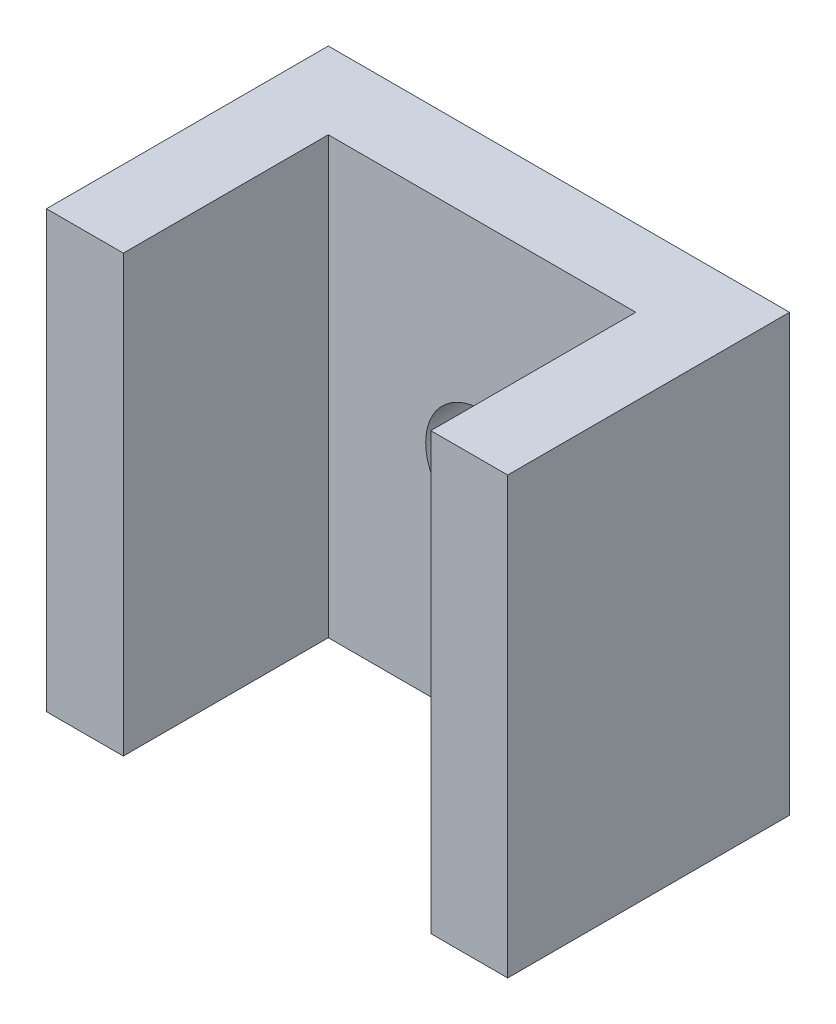
ISO-10303-21;
HEADER;
FILE_DESCRIPTION(('STEP AP214'),'2;1');
FILE_NAME('part.step','',(''),(''),'','','');
FILE_SCHEMA(('AUTOMOTIVE_DESIGN { 1 0 10303 214 1 1 1 1 }'));
ENDSEC;
DATA;
#1=APPLICATION_CONTEXT('core data for automotive mechanical design processes');
#2=APPLICATION_PROTOCOL_DEFINITION('international standard','automotive_design',2000,#1);
#3=PRODUCT_CONTEXT('',#1,'mechanical');
#4=PRODUCT('Part','Part','',(#3));
#5=PRODUCT_RELATED_PRODUCT_CATEGORY('part','',(#4));
#6=PRODUCT_DEFINITION_FORMATION('','',#4);
#7=PRODUCT_DEFINITION_CONTEXT('part definition',#1,'design');
#8=PRODUCT_DEFINITION('design','',#6,#7);
#9=PRODUCT_DEFINITION_SHAPE('','',#8);
#10=(LENGTH_UNIT() NAMED_UNIT(*) SI_UNIT(.MILLI.,.METRE.));
#11=(NAMED_UNIT(*) PLANE_ANGLE_UNIT() SI_UNIT($,.RADIAN.));
#12=(NAMED_UNIT(*) SI_UNIT($,.STERADIAN.) SOLID_ANGLE_UNIT());
#13=UNCERTAINTY_MEASURE_WITH_UNIT(LENGTH_MEASURE(1.E-05),#10,'distance_accuracy_value','');
#14=(GEOMETRIC_REPRESENTATION_CONTEXT(3) GLOBAL_UNCERTAINTY_ASSIGNED_CONTEXT((#13)) GLOBAL_UNIT_ASSIGNED_CONTEXT((#10,
#11,#12)) REPRESENTATION_CONTEXT('',''));
#15=CARTESIAN_POINT('',(0.,0.,0.));
#16=DIRECTION('',(0.,0.,1.));
#17=DIRECTION('',(1.,0.,0.));
#18=AXIS2_PLACEMENT_3D('',#15,#16,#17);
#19=CARTESIAN_POINT('',(3.,17.,0.));
#20=DIRECTION('',(0.,0.,-1.));
#21=DIRECTION('',(-1.,0.,0.));
#22=AXIS2_PLACEMENT_3D('',#19,#20,#21);
#23=PLANE('',#22);
#24=DIRECTION('',(1.,0.,0.));
#25=VECTOR('',#24,1.);
#26=CARTESIAN_POINT('',(3.,0.,0.));
#27=LINE('',#26,#25);
#28=CARTESIAN_POINT('',(0.,0.,0.));
#29=VERTEX_POINT('',#28);
#30=CARTESIAN_POINT('',(3.,0.,0.));
#31=VERTEX_POINT('',#30);
#32=EDGE_CURVE('E140',#29,#31,#27,.T.);
#33=ORIENTED_EDGE('',*,*,#32,.T.);
#34=DIRECTION('',(0.,-1.,0.));
#35=VECTOR('',#34,1.);
#36=CARTESIAN_POINT('',(3.,17.,0.));
#37=LINE('',#36,#35);
#38=CARTESIAN_POINT('',(3.,17.,0.));
#39=VERTEX_POINT('',#38);
#40=EDGE_CURVE('E11',#39,#31,#37,.T.);
#41=ORIENTED_EDGE('',*,*,#40,.F.);
#42=DIRECTION('',(1.,0.,0.));
#43=VECTOR('',#42,1.);
#44=CARTESIAN_POINT('',(3.,17.,0.));
#45=LINE('',#44,#43);
#46=CARTESIAN_POINT('',(0.,17.,0.));
#47=VERTEX_POINT('',#46);
#48=EDGE_CURVE('E163',#47,#39,#45,.T.);
#49=ORIENTED_EDGE('',*,*,#48,.F.);
#50=DIRECTION('',(0.,-1.,0.));
#51=VECTOR('',#50,1.);
#52=CARTESIAN_POINT('',(0.,17.,0.));
#53=LINE('',#52,#51);
#54=EDGE_CURVE('E136',#47,#29,#53,.T.);
#55=ORIENTED_EDGE('',*,*,#54,.T.);
#56=EDGE_LOOP('',(#33,#41,#49,#55));
#57=FACE_BOUND('',#56,.T.);
#58=ADVANCED_FACE('F39',(#57),#23,.F.);
#59=CARTESIAN_POINT('',(3.,17.,-8.));
#60=DIRECTION('',(-1.,0.,0.));
#61=DIRECTION('',(0.,0.,1.));
#62=AXIS2_PLACEMENT_3D('',#59,#60,#61);
#63=PLANE('',#62);
#64=DIRECTION('',(0.,0.,-1.));
#65=VECTOR('',#64,1.);
#66=CARTESIAN_POINT('',(3.,0.,-8.));
#67=LINE('',#66,#65);
#68=CARTESIAN_POINT('',(3.,0.,-8.));
#69=VERTEX_POINT('',#68);
#70=EDGE_CURVE('E144',#31,#69,#67,.T.);
#71=ORIENTED_EDGE('',*,*,#70,.T.);
#72=DIRECTION('',(0.,-1.,0.));
#73=VECTOR('',#72,1.);
#74=CARTESIAN_POINT('',(3.,17.,-8.));
#75=LINE('',#74,#73);
#76=CARTESIAN_POINT('',(3.,17.,-8.));
#77=VERTEX_POINT('',#76);
#78=EDGE_CURVE('E48',#77,#69,#75,.T.);
#79=ORIENTED_EDGE('',*,*,#78,.F.);
#80=DIRECTION('',(0.,0.,-1.));
#81=VECTOR('',#80,1.);
#82=CARTESIAN_POINT('',(3.,17.,-8.));
#83=LINE('',#82,#81);
#84=EDGE_CURVE('E99',#39,#77,#83,.T.);
#85=ORIENTED_EDGE('',*,*,#84,.F.);
#86=ORIENTED_EDGE('',*,*,#40,.T.);
#87=EDGE_LOOP('',(#71,#79,#85,#86));
#88=FACE_BOUND('',#87,.T.);
#89=ADVANCED_FACE('F228',(#88),#63,.F.);
#90=CARTESIAN_POINT('',(15.,17.,-8.));
#91=DIRECTION('',(0.,0.,-1.));
#92=DIRECTION('',(-1.,0.,0.));
#93=AXIS2_PLACEMENT_3D('',#90,#91,#92);
#94=PLANE('',#93);
#95=CARTESIAN_POINT('',(9.,8.5,-8.));
#96=DIRECTION('',(0.,0.,-1.));
#97=DIRECTION('',(-1.,0.,0.));
#98=AXIS2_PLACEMENT_3D('',#95,#96,#97);
#99=CIRCLE('',#98,2.2);
#100=CARTESIAN_POINT('',(6.8,8.5,-8.));
#101=VERTEX_POINT('',#100);
#102=EDGE_CURVE('E145',#101,#101,#99,.T.);
#103=ORIENTED_EDGE('',*,*,#102,.T.);
#104=EDGE_LOOP('',(#103));
#105=FACE_BOUND('',#104,.T.);
#106=DIRECTION('',(1.,0.,0.));
#107=VECTOR('',#106,1.);
#108=CARTESIAN_POINT('',(15.,0.,-8.));
#109=LINE('',#108,#107);
#110=CARTESIAN_POINT('',(15.,0.,-8.));
#111=VERTEX_POINT('',#110);
#112=EDGE_CURVE('E148',#69,#111,#109,.T.);
#113=ORIENTED_EDGE('',*,*,#112,.T.);
#114=DIRECTION('',(0.,-1.,0.));
#115=VECTOR('',#114,1.);
#116=CARTESIAN_POINT('',(15.,17.,-8.));
#117=LINE('',#116,#115);
#118=CARTESIAN_POINT('',(15.,17.,-8.));
#119=VERTEX_POINT('',#118);
#120=EDGE_CURVE('E174',#119,#111,#117,.T.);
#121=ORIENTED_EDGE('',*,*,#120,.F.);
#122=DIRECTION('',(1.,0.,0.));
#123=VECTOR('',#122,1.);
#124=CARTESIAN_POINT('',(15.,17.,-8.));
#125=LINE('',#124,#123);
#126=EDGE_CURVE('E184',#77,#119,#125,.T.);
#127=ORIENTED_EDGE('',*,*,#126,.F.);
#128=ORIENTED_EDGE('',*,*,#78,.T.);
#129=EDGE_LOOP('',(#113,#121,#127,#128));
#130=FACE_BOUND('',#129,.T.);
#131=ADVANCED_FACE('F182',(#105,#130),#94,.F.);
#132=CARTESIAN_POINT('',(15.,17.,0.));
#133=DIRECTION('',(1.,0.,0.));
#134=DIRECTION('',(0.,0.,-1.));
#135=AXIS2_PLACEMENT_3D('',#132,#133,#134);
#136=PLANE('',#135);
#137=DIRECTION('',(0.,0.,1.));
#138=VECTOR('',#137,1.);
#139=CARTESIAN_POINT('',(15.,0.,0.));
#140=LINE('',#139,#138);
#141=CARTESIAN_POINT('',(15.,0.,0.));
#142=VERTEX_POINT('',#141);
#143=EDGE_CURVE('E151',#111,#142,#140,.T.);
#144=ORIENTED_EDGE('',*,*,#143,.T.);
#145=DIRECTION('',(0.,-1.,0.));
#146=VECTOR('',#145,1.);
#147=CARTESIAN_POINT('',(15.,17.,0.));
#148=LINE('',#147,#146);
#149=CARTESIAN_POINT('',(15.,17.,0.));
#150=VERTEX_POINT('',#149);
#151=EDGE_CURVE('E170',#150,#142,#148,.T.);
#152=ORIENTED_EDGE('',*,*,#151,.F.);
#153=DIRECTION('',(0.,0.,1.));
#154=VECTOR('',#153,1.);
#155=CARTESIAN_POINT('',(15.,17.,0.));
#156=LINE('',#155,#154);
#157=EDGE_CURVE('E197',#119,#150,#156,.T.);
#158=ORIENTED_EDGE('',*,*,#157,.F.);
#159=ORIENTED_EDGE('',*,*,#120,.T.);
#160=EDGE_LOOP('',(#144,#152,#158,#159));
#161=FACE_BOUND('',#160,.T.);
#162=ADVANCED_FACE('F192',(#161),#136,.F.);
#163=CARTESIAN_POINT('',(18.,17.,0.));
#164=DIRECTION('',(0.,0.,-1.));
#165=DIRECTION('',(-1.,0.,0.));
#166=AXIS2_PLACEMENT_3D('',#163,#164,#165);
#167=PLANE('',#166);
#168=DIRECTION('',(1.,0.,0.));
#169=VECTOR('',#168,1.);
#170=CARTESIAN_POINT('',(18.,0.,0.));
#171=LINE('',#170,#169);
#172=CARTESIAN_POINT('',(18.,0.,0.));
#173=VERTEX_POINT('',#172);
#174=EDGE_CURVE('E154',#142,#173,#171,.T.);
#175=ORIENTED_EDGE('',*,*,#174,.T.);
#176=DIRECTION('',(0.,-1.,0.));
#177=VECTOR('',#176,1.);
#178=CARTESIAN_POINT('',(18.,17.,0.));
#179=LINE('',#178,#177);
#180=CARTESIAN_POINT('',(18.,17.,0.));
#181=VERTEX_POINT('',#180);
#182=EDGE_CURVE('E129',#181,#173,#179,.T.);
#183=ORIENTED_EDGE('',*,*,#182,.F.);
#184=DIRECTION('',(1.,0.,0.));
#185=VECTOR('',#184,1.);
#186=CARTESIAN_POINT('',(18.,17.,0.));
#187=LINE('',#186,#185);
#188=EDGE_CURVE('E118',#150,#181,#187,.T.);
#189=ORIENTED_EDGE('',*,*,#188,.F.);
#190=ORIENTED_EDGE('',*,*,#151,.T.);
#191=EDGE_LOOP('',(#175,#183,#189,#190));
#192=FACE_BOUND('',#191,.T.);
#193=ADVANCED_FACE('F195',(#192),#167,.F.);
#194=CARTESIAN_POINT('',(18.,17.,-11.));
#195=DIRECTION('',(-1.,0.,0.));
#196=DIRECTION('',(0.,0.,1.));
#197=AXIS2_PLACEMENT_3D('',#194,#195,#196);
#198=PLANE('',#197);
#199=DIRECTION('',(0.,0.,-1.));
#200=VECTOR('',#199,1.);
#201=CARTESIAN_POINT('',(18.,0.,-11.));
#202=LINE('',#201,#200);
#203=CARTESIAN_POINT('',(18.,0.,-11.));
#204=VERTEX_POINT('',#203);
#205=EDGE_CURVE('E127',#173,#204,#202,.T.);
#206=ORIENTED_EDGE('',*,*,#205,.T.);
#207=DIRECTION('',(0.,-1.,0.));
#208=VECTOR('',#207,1.);
#209=CARTESIAN_POINT('',(18.,17.,-11.));
#210=LINE('',#209,#208);
#211=CARTESIAN_POINT('',(18.,17.,-11.));
#212=VERTEX_POINT('',#211);
#213=EDGE_CURVE('E124',#212,#204,#210,.T.);
#214=ORIENTED_EDGE('',*,*,#213,.F.);
#215=DIRECTION('',(0.,0.,-1.));
#216=VECTOR('',#215,1.);
#217=CARTESIAN_POINT('',(18.,17.,-11.));
#218=LINE('',#217,#216);
#219=EDGE_CURVE('E112',#181,#212,#218,.T.);
#220=ORIENTED_EDGE('',*,*,#219,.F.);
#221=ORIENTED_EDGE('',*,*,#182,.T.);
#222=EDGE_LOOP('',(#206,#214,#220,#221));
#223=FACE_BOUND('',#222,.T.);
#224=ADVANCED_FACE('F125',(#223),#198,.F.);
#225=CARTESIAN_POINT('',(0.,17.,-11.));
#226=DIRECTION('',(0.,0.,1.));
#227=DIRECTION('',(1.,0.,0.));
#228=AXIS2_PLACEMENT_3D('',#225,#226,#227);
#229=PLANE('',#228);
#230=CARTESIAN_POINT('',(9.,8.5,-11.));
#231=DIRECTION('',(0.,0.,-1.));
#232=DIRECTION('',(-1.,0.,0.));
#233=AXIS2_PLACEMENT_3D('',#230,#231,#232);
#234=CIRCLE('',#233,2.2);
#235=CARTESIAN_POINT('',(6.8,8.5,-11.));
#236=VERTEX_POINT('',#235);
#237=EDGE_CURVE('E210',#236,#236,#234,.T.);
#238=ORIENTED_EDGE('',*,*,#237,.F.);
#239=EDGE_LOOP('',(#238));
#240=FACE_BOUND('',#239,.T.);
#241=DIRECTION('',(-1.,0.,0.));
#242=VECTOR('',#241,1.);
#243=CARTESIAN_POINT('',(0.,0.,-11.));
#244=LINE('',#243,#242);
#245=CARTESIAN_POINT('',(0.,0.,-11.));
#246=VERTEX_POINT('',#245);
#247=EDGE_CURVE('E85',#204,#246,#244,.T.);
#248=ORIENTED_EDGE('',*,*,#247,.T.);
#249=DIRECTION('',(0.,-1.,0.));
#250=VECTOR('',#249,1.);
#251=CARTESIAN_POINT('',(0.,17.,-11.));
#252=LINE('',#251,#250);
#253=CARTESIAN_POINT('',(0.,17.,-11.));
#254=VERTEX_POINT('',#253);
#255=EDGE_CURVE('E130',#254,#246,#252,.T.);
#256=ORIENTED_EDGE('',*,*,#255,.F.);
#257=DIRECTION('',(-1.,0.,0.));
#258=VECTOR('',#257,1.);
#259=CARTESIAN_POINT('',(0.,17.,-11.));
#260=LINE('',#259,#258);
#261=EDGE_CURVE('E116',#212,#254,#260,.T.);
#262=ORIENTED_EDGE('',*,*,#261,.F.);
#263=ORIENTED_EDGE('',*,*,#213,.T.);
#264=EDGE_LOOP('',(#248,#256,#262,#263));
#265=FACE_BOUND('',#264,.T.);
#266=ADVANCED_FACE('F132',(#240,#265),#229,.F.);
#267=CARTESIAN_POINT('',(0.,17.,0.));
#268=DIRECTION('',(1.,0.,0.));
#269=DIRECTION('',(0.,0.,-1.));
#270=AXIS2_PLACEMENT_3D('',#267,#268,#269);
#271=PLANE('',#270);
#272=DIRECTION('',(0.,0.,1.));
#273=VECTOR('',#272,1.);
#274=CARTESIAN_POINT('',(0.,0.,0.));
#275=LINE('',#274,#273);
#276=EDGE_CURVE('E91',#246,#29,#275,.T.);
#277=ORIENTED_EDGE('',*,*,#276,.T.);
#278=ORIENTED_EDGE('',*,*,#54,.F.);
#279=DIRECTION('',(0.,0.,1.));
#280=VECTOR('',#279,1.);
#281=CARTESIAN_POINT('',(0.,17.,0.));
#282=LINE('',#281,#280);
#283=EDGE_CURVE('E56',#254,#47,#282,.T.);
#284=ORIENTED_EDGE('',*,*,#283,.F.);
#285=ORIENTED_EDGE('',*,*,#255,.T.);
#286=EDGE_LOOP('',(#277,#278,#284,#285));
#287=FACE_BOUND('',#286,.T.);
#288=ADVANCED_FACE('F219',(#287),#271,.F.);
#289=CARTESIAN_POINT('',(0.,17.,0.));
#290=DIRECTION('',(0.,-1.,0.));
#291=DIRECTION('',(0.,0.,-1.));
#292=AXIS2_PLACEMENT_3D('',#289,#290,#291);
#293=PLANE('',#292);
#294=ORIENTED_EDGE('',*,*,#48,.T.);
#295=ORIENTED_EDGE('',*,*,#84,.T.);
#296=ORIENTED_EDGE('',*,*,#126,.T.);
#297=ORIENTED_EDGE('',*,*,#157,.T.);
#298=ORIENTED_EDGE('',*,*,#188,.T.);
#299=ORIENTED_EDGE('',*,*,#219,.T.);
#300=ORIENTED_EDGE('',*,*,#261,.T.);
#301=ORIENTED_EDGE('',*,*,#283,.T.);
#302=EDGE_LOOP('',(#294,#295,#296,#297,#298,#299,#300,#301));
#303=FACE_BOUND('',#302,.T.);
#304=ADVANCED_FACE('F114',(#303),#293,.F.);
#305=CARTESIAN_POINT('',(0.,0.,0.));
#306=DIRECTION('',(0.,-1.,0.));
#307=DIRECTION('',(0.,0.,-1.));
#308=AXIS2_PLACEMENT_3D('',#305,#306,#307);
#309=PLANE('',#308);
#310=ORIENTED_EDGE('',*,*,#32,.F.);
#311=ORIENTED_EDGE('',*,*,#276,.F.);
#312=ORIENTED_EDGE('',*,*,#247,.F.);
#313=ORIENTED_EDGE('',*,*,#205,.F.);
#314=ORIENTED_EDGE('',*,*,#174,.F.);
#315=ORIENTED_EDGE('',*,*,#143,.F.);
#316=ORIENTED_EDGE('',*,*,#112,.F.);
#317=ORIENTED_EDGE('',*,*,#70,.F.);
#318=EDGE_LOOP('',(#310,#311,#312,#313,#314,#315,#316,#317));
#319=FACE_BOUND('',#318,.T.);
#320=ADVANCED_FACE('F188',(#319),#309,.T.);
#321=CARTESIAN_POINT('',(9.,8.5,6.));
#322=DIRECTION('',(0.,0.,-1.));
#323=DIRECTION('',(-1.,0.,0.));
#324=AXIS2_PLACEMENT_3D('',#321,#322,#323);
#325=CYLINDRICAL_SURFACE('',#324,2.2);
#326=ORIENTED_EDGE('',*,*,#237,.T.);
#327=EDGE_LOOP('',(#326));
#328=FACE_BOUND('',#327,.T.);
#329=ORIENTED_EDGE('',*,*,#102,.F.);
#330=EDGE_LOOP('',(#329));
#331=FACE_BOUND('',#330,.T.);
#332=ADVANCED_FACE('F215',(#328,#331),#325,.F.);
#333=CLOSED_SHELL('',(#58,#89,#131,#162,#193,#224,#266,#288,#304,#320,#332));
#334=MANIFOLD_SOLID_BREP('B2',#333);
#335=ADVANCED_BREP_SHAPE_REPRESENTATION('',(#18,#334),#14);
#336=SHAPE_DEFINITION_REPRESENTATION(#9,#335);
ENDSEC;
END-ISO-10303-21;
